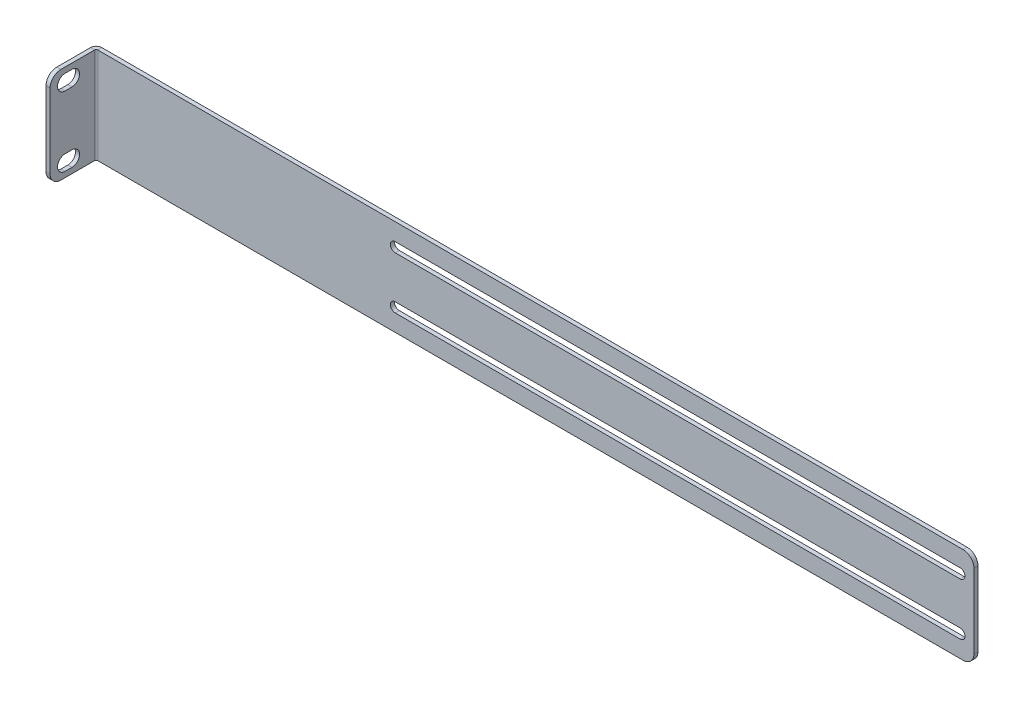
ISO-10303-21;
HEADER;
FILE_DESCRIPTION(('STEP AP214'),'2;1');
FILE_NAME('part.step','',(''),(''),'','','');
FILE_SCHEMA(('AUTOMOTIVE_DESIGN { 1 0 10303 214 1 1 1 1 }'));
ENDSEC;
DATA;
#1=APPLICATION_CONTEXT('core data for automotive mechanical design processes');
#2=APPLICATION_PROTOCOL_DEFINITION('international standard','automotive_design',2000,#1);
#3=PRODUCT_CONTEXT('',#1,'mechanical');
#4=PRODUCT('Part','Part','',(#3));
#5=PRODUCT_RELATED_PRODUCT_CATEGORY('part','',(#4));
#6=PRODUCT_DEFINITION_FORMATION('','',#4);
#7=PRODUCT_DEFINITION_CONTEXT('part definition',#1,'design');
#8=PRODUCT_DEFINITION('design','',#6,#7);
#9=PRODUCT_DEFINITION_SHAPE('','',#8);
#10=(LENGTH_UNIT() NAMED_UNIT(*) SI_UNIT(.MILLI.,.METRE.));
#11=(NAMED_UNIT(*) PLANE_ANGLE_UNIT() SI_UNIT($,.RADIAN.));
#12=(NAMED_UNIT(*) SI_UNIT($,.STERADIAN.) SOLID_ANGLE_UNIT());
#13=UNCERTAINTY_MEASURE_WITH_UNIT(LENGTH_MEASURE(1.E-05),#10,'distance_accuracy_value','');
#14=(GEOMETRIC_REPRESENTATION_CONTEXT(3) GLOBAL_UNCERTAINTY_ASSIGNED_CONTEXT((#13)) GLOBAL_UNIT_ASSIGNED_CONTEXT((#10,
#11,#12)) REPRESENTATION_CONTEXT('',''));
#15=CARTESIAN_POINT('',(0.,0.,0.));
#16=DIRECTION('',(0.,0.,1.));
#17=DIRECTION('',(1.,0.,0.));
#18=AXIS2_PLACEMENT_3D('',#15,#16,#17);
#19=CARTESIAN_POINT('',(0.,0.,-1.88));
#20=DIRECTION('',(0.,-1.,0.));
#21=DIRECTION('',(0.,0.,-1.));
#22=AXIS2_PLACEMENT_3D('',#19,#20,#21);
#23=PLANE('',#22);
#24=DIRECTION('',(1.,0.,0.));
#25=VECTOR('',#24,1.);
#26=CARTESIAN_POINT('',(0.,0.,-1.88));
#27=LINE('',#26,#25);
#28=CARTESIAN_POINT('',(2.6166,0.,-1.88));
#29=VERTEX_POINT('',#28);
#30=CARTESIAN_POINT('',(401.4,0.,-1.88));
#31=VERTEX_POINT('',#30);
#32=EDGE_CURVE('E436',#29,#31,#27,.T.);
#33=ORIENTED_EDGE('',*,*,#32,.T.);
#34=DIRECTION('',(0.,0.,1.));
#35=VECTOR('',#34,1.);
#36=CARTESIAN_POINT('',(401.4,0.,-1.88));
#37=LINE('',#36,#35);
#38=CARTESIAN_POINT('',(401.4,0.,0.));
#39=VERTEX_POINT('',#38);
#40=EDGE_CURVE('E445',#31,#39,#37,.T.);
#41=ORIENTED_EDGE('',*,*,#40,.T.);
#42=DIRECTION('',(1.,0.,0.));
#43=VECTOR('',#42,1.);
#44=CARTESIAN_POINT('',(0.,0.,0.));
#45=LINE('',#44,#43);
#46=CARTESIAN_POINT('',(2.6166,0.,0.));
#47=VERTEX_POINT('',#46);
#48=EDGE_CURVE('E429',#47,#39,#45,.T.);
#49=ORIENTED_EDGE('',*,*,#48,.F.);
#50=DIRECTION('',(0.,0.,-1.));
#51=VECTOR('',#50,1.);
#52=CARTESIAN_POINT('',(2.6166,0.,0.));
#53=LINE('',#52,#51);
#54=EDGE_CURVE('E355',#47,#29,#53,.T.);
#55=ORIENTED_EDGE('',*,*,#54,.T.);
#56=EDGE_LOOP('',(#33,#41,#49,#55));
#57=FACE_BOUND('',#56,.T.);
#58=ADVANCED_FACE('F61',(#57),#23,.T.);
#59=CARTESIAN_POINT('',(0.,0.,-1.88));
#60=DIRECTION('',(0.,0.,-1.));
#61=DIRECTION('',(-1.,0.,0.));
#62=AXIS2_PLACEMENT_3D('',#59,#60,#61);
#63=PLANE('',#62);
#64=CARTESIAN_POINT('',(139.7,9.99999999999994,-1.88));
#65=DIRECTION('',(0.,0.,1.));
#66=DIRECTION('',(1.,0.,0.));
#67=AXIS2_PLACEMENT_3D('',#64,#65,#66);
#68=CIRCLE('',#67,2.2225);
#69=CARTESIAN_POINT('',(139.7,12.2224999999999,-1.88));
#70=VERTEX_POINT('',#69);
#71=CARTESIAN_POINT('',(139.7,7.77749999999994,-1.88));
#72=VERTEX_POINT('',#71);
#73=EDGE_CURVE('E372',#70,#72,#68,.T.);
#74=ORIENTED_EDGE('',*,*,#73,.T.);
#75=DIRECTION('',(1.,0.,0.));
#76=VECTOR('',#75,1.);
#77=CARTESIAN_POINT('',(139.7,7.77749999999994,-1.88));
#78=LINE('',#77,#76);
#79=CARTESIAN_POINT('',(400.05,7.7775,-1.88));
#80=VERTEX_POINT('',#79);
#81=EDGE_CURVE('E375',#72,#80,#78,.T.);
#82=ORIENTED_EDGE('',*,*,#81,.T.);
#83=CARTESIAN_POINT('',(400.05,9.99999999999997,-1.88));
#84=DIRECTION('',(0.,0.,1.));
#85=DIRECTION('',(1.,0.,0.));
#86=AXIS2_PLACEMENT_3D('',#83,#84,#85);
#87=CIRCLE('',#86,2.2225);
#88=CARTESIAN_POINT('',(400.05,12.2225,-1.88));
#89=VERTEX_POINT('',#88);
#90=EDGE_CURVE('E379',#80,#89,#87,.T.);
#91=ORIENTED_EDGE('',*,*,#90,.T.);
#92=DIRECTION('',(-1.,0.,0.));
#93=VECTOR('',#92,1.);
#94=CARTESIAN_POINT('',(139.7,12.2224999999999,-1.88));
#95=LINE('',#94,#93);
#96=EDGE_CURVE('E382',#89,#70,#95,.T.);
#97=ORIENTED_EDGE('',*,*,#96,.T.);
#98=EDGE_LOOP('',(#74,#82,#91,#97));
#99=FACE_BOUND('',#98,.T.);
#100=CARTESIAN_POINT('',(139.7,33.9999999999999,-1.88));
#101=DIRECTION('',(0.,0.,1.));
#102=DIRECTION('',(1.,0.,0.));
#103=AXIS2_PLACEMENT_3D('',#100,#101,#102);
#104=CIRCLE('',#103,2.22250000000001);
#105=CARTESIAN_POINT('',(139.7,36.2224999999999,-1.88));
#106=VERTEX_POINT('',#105);
#107=CARTESIAN_POINT('',(139.7,31.7774999999999,-1.88));
#108=VERTEX_POINT('',#107);
#109=EDGE_CURVE('E404',#106,#108,#104,.T.);
#110=ORIENTED_EDGE('',*,*,#109,.T.);
#111=DIRECTION('',(1.,0.,0.));
#112=VECTOR('',#111,1.);
#113=CARTESIAN_POINT('',(139.7,31.7774999999999,-1.88));
#114=LINE('',#113,#112);
#115=CARTESIAN_POINT('',(400.05,31.7775,-1.88));
#116=VERTEX_POINT('',#115);
#117=EDGE_CURVE('E407',#108,#116,#114,.T.);
#118=ORIENTED_EDGE('',*,*,#117,.T.);
#119=CARTESIAN_POINT('',(400.05,34.,-1.88));
#120=DIRECTION('',(0.,0.,1.));
#121=DIRECTION('',(1.,0.,0.));
#122=AXIS2_PLACEMENT_3D('',#119,#120,#121);
#123=CIRCLE('',#122,2.2225);
#124=CARTESIAN_POINT('',(400.05,36.2225,-1.88));
#125=VERTEX_POINT('',#124);
#126=EDGE_CURVE('E411',#116,#125,#123,.T.);
#127=ORIENTED_EDGE('',*,*,#126,.T.);
#128=DIRECTION('',(-1.,0.,0.));
#129=VECTOR('',#128,1.);
#130=CARTESIAN_POINT('',(139.7,36.2224999999999,-1.88));
#131=LINE('',#130,#129);
#132=EDGE_CURVE('E414',#125,#106,#131,.T.);
#133=ORIENTED_EDGE('',*,*,#132,.T.);
#134=EDGE_LOOP('',(#110,#118,#127,#133));
#135=FACE_BOUND('',#134,.T.);
#136=DIRECTION('',(0.,1.,0.));
#137=VECTOR('',#136,1.);
#138=CARTESIAN_POINT('',(406.4,0.,-1.88));
#139=LINE('',#138,#137);
#140=CARTESIAN_POINT('',(406.4,5.,-1.88));
#141=VERTEX_POINT('',#140);
#142=CARTESIAN_POINT('',(406.4,39.196,-1.88));
#143=VERTEX_POINT('',#142);
#144=EDGE_CURVE('E439',#141,#143,#139,.T.);
#145=ORIENTED_EDGE('',*,*,#144,.F.);
#146=CARTESIAN_POINT('',(401.4,5.,-1.88));
#147=DIRECTION('',(0.,0.,-1.));
#148=DIRECTION('',(-1.,0.,0.));
#149=AXIS2_PLACEMENT_3D('',#146,#147,#148);
#150=CIRCLE('',#149,5.);
#151=EDGE_CURVE('E465',#141,#31,#150,.T.);
#152=ORIENTED_EDGE('',*,*,#151,.T.);
#153=ORIENTED_EDGE('',*,*,#32,.F.);
#154=DIRECTION('',(0.,-1.,0.));
#155=VECTOR('',#154,1.);
#156=CARTESIAN_POINT('',(2.6166,0.,-1.88));
#157=LINE('',#156,#155);
#158=CARTESIAN_POINT('',(2.6166,44.196,-1.88));
#159=VERTEX_POINT('',#158);
#160=EDGE_CURVE('E348',#29,#159,#157,.F.);
#161=ORIENTED_EDGE('',*,*,#160,.T.);
#162=DIRECTION('',(-1.,0.,0.));
#163=VECTOR('',#162,1.);
#164=CARTESIAN_POINT('',(0.,44.196,-1.88));
#165=LINE('',#164,#163);
#166=CARTESIAN_POINT('',(401.4,44.196,-1.88));
#167=VERTEX_POINT('',#166);
#168=EDGE_CURVE('E443',#167,#159,#165,.T.);
#169=ORIENTED_EDGE('',*,*,#168,.F.);
#170=CARTESIAN_POINT('',(401.4,39.196,-1.88));
#171=DIRECTION('',(0.,0.,-1.));
#172=DIRECTION('',(-1.,0.,0.));
#173=AXIS2_PLACEMENT_3D('',#170,#171,#172);
#174=CIRCLE('',#173,5.);
#175=EDGE_CURVE('E463',#167,#143,#174,.T.);
#176=ORIENTED_EDGE('',*,*,#175,.T.);
#177=EDGE_LOOP('',(#145,#152,#153,#161,#169,#176));
#178=FACE_BOUND('',#177,.T.);
#179=ADVANCED_FACE('F521',(#99,#135,#178),#63,.T.);
#180=CARTESIAN_POINT('',(0.,0.,0.));
#181=DIRECTION('',(0.,0.,-1.));
#182=DIRECTION('',(-1.,0.,0.));
#183=AXIS2_PLACEMENT_3D('',#180,#181,#182);
#184=PLANE('',#183);
#185=DIRECTION('',(1.,0.,0.));
#186=VECTOR('',#185,1.);
#187=CARTESIAN_POINT('',(139.7,31.7774999999999,0.));
#188=LINE('',#187,#186);
#189=CARTESIAN_POINT('',(139.7,31.7774999999999,0.));
#190=VERTEX_POINT('',#189);
#191=CARTESIAN_POINT('',(400.05,31.7775,0.));
#192=VERTEX_POINT('',#191);
#193=EDGE_CURVE('E419',#190,#192,#188,.T.);
#194=ORIENTED_EDGE('',*,*,#193,.F.);
#195=CARTESIAN_POINT('',(139.7,33.9999999999999,0.));
#196=DIRECTION('',(0.,0.,1.));
#197=DIRECTION('',(1.,0.,0.));
#198=AXIS2_PLACEMENT_3D('',#195,#196,#197);
#199=CIRCLE('',#198,2.22250000000001);
#200=CARTESIAN_POINT('',(139.7,36.2224999999999,0.));
#201=VERTEX_POINT('',#200);
#202=EDGE_CURVE('E397',#201,#190,#199,.T.);
#203=ORIENTED_EDGE('',*,*,#202,.F.);
#204=DIRECTION('',(-1.,0.,0.));
#205=VECTOR('',#204,1.);
#206=CARTESIAN_POINT('',(139.7,36.2224999999999,0.));
#207=LINE('',#206,#205);
#208=CARTESIAN_POINT('',(400.05,36.2225,0.));
#209=VERTEX_POINT('',#208);
#210=EDGE_CURVE('E408',#209,#201,#207,.T.);
#211=ORIENTED_EDGE('',*,*,#210,.F.);
#212=CARTESIAN_POINT('',(400.05,34.,0.));
#213=DIRECTION('',(0.,0.,1.));
#214=DIRECTION('',(1.,0.,0.));
#215=AXIS2_PLACEMENT_3D('',#212,#213,#214);
#216=CIRCLE('',#215,2.2225);
#217=EDGE_CURVE('E422',#192,#209,#216,.T.);
#218=ORIENTED_EDGE('',*,*,#217,.F.);
#219=EDGE_LOOP('',(#194,#203,#211,#218));
#220=FACE_BOUND('',#219,.T.);
#221=DIRECTION('',(1.,0.,0.));
#222=VECTOR('',#221,1.);
#223=CARTESIAN_POINT('',(139.7,7.77749999999994,0.));
#224=LINE('',#223,#222);
#225=CARTESIAN_POINT('',(139.7,7.77749999999994,0.));
#226=VERTEX_POINT('',#225);
#227=CARTESIAN_POINT('',(400.05,7.77749999999997,0.));
#228=VERTEX_POINT('',#227);
#229=EDGE_CURVE('E387',#226,#228,#224,.T.);
#230=ORIENTED_EDGE('',*,*,#229,.F.);
#231=CARTESIAN_POINT('',(139.7,9.99999999999994,0.));
#232=DIRECTION('',(0.,0.,1.));
#233=DIRECTION('',(1.,0.,0.));
#234=AXIS2_PLACEMENT_3D('',#231,#232,#233);
#235=CIRCLE('',#234,2.2225);
#236=CARTESIAN_POINT('',(139.7,12.2224999999999,0.));
#237=VERTEX_POINT('',#236);
#238=EDGE_CURVE('E369',#237,#226,#235,.T.);
#239=ORIENTED_EDGE('',*,*,#238,.F.);
#240=DIRECTION('',(-1.,0.,0.));
#241=VECTOR('',#240,1.);
#242=CARTESIAN_POINT('',(139.7,12.2224999999999,0.));
#243=LINE('',#242,#241);
#244=CARTESIAN_POINT('',(400.05,12.2225,0.));
#245=VERTEX_POINT('',#244);
#246=EDGE_CURVE('E376',#245,#237,#243,.T.);
#247=ORIENTED_EDGE('',*,*,#246,.F.);
#248=CARTESIAN_POINT('',(400.05,9.99999999999997,0.));
#249=DIRECTION('',(0.,0.,1.));
#250=DIRECTION('',(1.,0.,0.));
#251=AXIS2_PLACEMENT_3D('',#248,#249,#250);
#252=CIRCLE('',#251,2.2225);
#253=EDGE_CURVE('E390',#228,#245,#252,.T.);
#254=ORIENTED_EDGE('',*,*,#253,.F.);
#255=EDGE_LOOP('',(#230,#239,#247,#254));
#256=FACE_BOUND('',#255,.T.);
#257=ORIENTED_EDGE('',*,*,#48,.T.);
#258=CARTESIAN_POINT('',(401.4,5.,0.));
#259=DIRECTION('',(0.,0.,-1.));
#260=DIRECTION('',(-1.,0.,0.));
#261=AXIS2_PLACEMENT_3D('',#258,#259,#260);
#262=CIRCLE('',#261,5.);
#263=CARTESIAN_POINT('',(406.4,5.,0.));
#264=VERTEX_POINT('',#263);
#265=EDGE_CURVE('E456',#39,#264,#262,.F.);
#266=ORIENTED_EDGE('',*,*,#265,.T.);
#267=DIRECTION('',(0.,1.,0.));
#268=VECTOR('',#267,1.);
#269=CARTESIAN_POINT('',(406.4,0.,0.));
#270=LINE('',#269,#268);
#271=CARTESIAN_POINT('',(406.4,39.196,0.));
#272=VERTEX_POINT('',#271);
#273=EDGE_CURVE('E448',#264,#272,#270,.T.);
#274=ORIENTED_EDGE('',*,*,#273,.T.);
#275=CARTESIAN_POINT('',(401.4,39.196,0.));
#276=DIRECTION('',(0.,0.,-1.));
#277=DIRECTION('',(-1.,0.,0.));
#278=AXIS2_PLACEMENT_3D('',#275,#276,#277);
#279=CIRCLE('',#278,5.);
#280=CARTESIAN_POINT('',(401.4,44.196,0.));
#281=VERTEX_POINT('',#280);
#282=EDGE_CURVE('E454',#272,#281,#279,.F.);
#283=ORIENTED_EDGE('',*,*,#282,.T.);
#284=DIRECTION('',(-1.,0.,0.));
#285=VECTOR('',#284,1.);
#286=CARTESIAN_POINT('',(0.,44.196,0.));
#287=LINE('',#286,#285);
#288=CARTESIAN_POINT('',(2.6166,44.196,0.));
#289=VERTEX_POINT('',#288);
#290=EDGE_CURVE('E440',#281,#289,#287,.T.);
#291=ORIENTED_EDGE('',*,*,#290,.T.);
#292=DIRECTION('',(0.,-1.,0.));
#293=VECTOR('',#292,1.);
#294=CARTESIAN_POINT('',(2.6166,0.,0.));
#295=LINE('',#294,#293);
#296=EDGE_CURVE('E361',#47,#289,#295,.F.);
#297=ORIENTED_EDGE('',*,*,#296,.F.);
#298=EDGE_LOOP('',(#257,#266,#274,#283,#291,#297));
#299=FACE_BOUND('',#298,.T.);
#300=ADVANCED_FACE('F531',(#220,#256,#299),#184,.F.);
#301=CARTESIAN_POINT('',(0.,44.196,-1.88));
#302=DIRECTION('',(0.,1.,0.));
#303=DIRECTION('',(0.,0.,1.));
#304=AXIS2_PLACEMENT_3D('',#301,#302,#303);
#305=PLANE('',#304);
#306=ORIENTED_EDGE('',*,*,#290,.F.);
#307=DIRECTION('',(0.,0.,1.));
#308=VECTOR('',#307,1.);
#309=CARTESIAN_POINT('',(401.4,44.196,-1.88));
#310=LINE('',#309,#308);
#311=EDGE_CURVE('E467',#281,#167,#310,.F.);
#312=ORIENTED_EDGE('',*,*,#311,.T.);
#313=ORIENTED_EDGE('',*,*,#168,.T.);
#314=DIRECTION('',(0.,0.,-1.));
#315=VECTOR('',#314,1.);
#316=CARTESIAN_POINT('',(2.6166,44.196,0.));
#317=LINE('',#316,#315);
#318=EDGE_CURVE('E366',#289,#159,#317,.T.);
#319=ORIENTED_EDGE('',*,*,#318,.F.);
#320=EDGE_LOOP('',(#306,#312,#313,#319));
#321=FACE_BOUND('',#320,.T.);
#322=ADVANCED_FACE('F515',(#321),#305,.T.);
#323=CARTESIAN_POINT('',(406.4,0.,-1.88));
#324=DIRECTION('',(1.,0.,0.));
#325=DIRECTION('',(0.,0.,-1.));
#326=AXIS2_PLACEMENT_3D('',#323,#324,#325);
#327=PLANE('',#326);
#328=ORIENTED_EDGE('',*,*,#273,.F.);
#329=DIRECTION('',(0.,0.,1.));
#330=VECTOR('',#329,1.);
#331=CARTESIAN_POINT('',(406.4,5.,-1.88));
#332=LINE('',#331,#330);
#333=EDGE_CURVE('E461',#264,#141,#332,.F.);
#334=ORIENTED_EDGE('',*,*,#333,.T.);
#335=ORIENTED_EDGE('',*,*,#144,.T.);
#336=DIRECTION('',(0.,0.,1.));
#337=VECTOR('',#336,1.);
#338=CARTESIAN_POINT('',(406.4,39.196,-1.88));
#339=LINE('',#338,#337);
#340=EDGE_CURVE('E458',#143,#272,#339,.T.);
#341=ORIENTED_EDGE('',*,*,#340,.T.);
#342=EDGE_LOOP('',(#328,#334,#335,#341));
#343=FACE_BOUND('',#342,.T.);
#344=ADVANCED_FACE('F528',(#343),#327,.T.);
#345=CARTESIAN_POINT('',(139.7,33.9999999999999,-1.88));
#346=DIRECTION('',(0.,0.,1.));
#347=DIRECTION('',(1.,0.,0.));
#348=AXIS2_PLACEMENT_3D('',#345,#346,#347);
#349=CYLINDRICAL_SURFACE('',#348,2.22250000000001);
#350=ORIENTED_EDGE('',*,*,#202,.T.);
#351=DIRECTION('',(0.,0.,1.));
#352=VECTOR('',#351,1.);
#353=CARTESIAN_POINT('',(139.7,31.7774999999999,-1.88));
#354=LINE('',#353,#352);
#355=EDGE_CURVE('E417',#108,#190,#354,.T.);
#356=ORIENTED_EDGE('',*,*,#355,.F.);
#357=ORIENTED_EDGE('',*,*,#109,.F.);
#358=DIRECTION('',(0.,0.,1.));
#359=VECTOR('',#358,1.);
#360=CARTESIAN_POINT('',(139.7,36.2224999999999,-1.88));
#361=LINE('',#360,#359);
#362=EDGE_CURVE('E427',#106,#201,#361,.T.);
#363=ORIENTED_EDGE('',*,*,#362,.T.);
#364=EDGE_LOOP('',(#350,#356,#357,#363));
#365=FACE_BOUND('',#364,.T.);
#366=ADVANCED_FACE('F640',(#365),#349,.F.);
#367=CARTESIAN_POINT('',(139.7,36.2224999999999,-1.88));
#368=DIRECTION('',(0.,1.,0.));
#369=DIRECTION('',(-1.,0.,0.));
#370=AXIS2_PLACEMENT_3D('',#367,#368,#369);
#371=PLANE('',#370);
#372=ORIENTED_EDGE('',*,*,#210,.T.);
#373=ORIENTED_EDGE('',*,*,#362,.F.);
#374=ORIENTED_EDGE('',*,*,#132,.F.);
#375=DIRECTION('',(0.,0.,1.));
#376=VECTOR('',#375,1.);
#377=CARTESIAN_POINT('',(400.05,36.2225,-1.88));
#378=LINE('',#377,#376);
#379=EDGE_CURVE('E430',#125,#209,#378,.T.);
#380=ORIENTED_EDGE('',*,*,#379,.T.);
#381=EDGE_LOOP('',(#372,#373,#374,#380));
#382=FACE_BOUND('',#381,.T.);
#383=ADVANCED_FACE('F851',(#382),#371,.F.);
#384=CARTESIAN_POINT('',(400.05,34.,-1.88));
#385=DIRECTION('',(0.,0.,1.));
#386=DIRECTION('',(1.,0.,0.));
#387=AXIS2_PLACEMENT_3D('',#384,#385,#386);
#388=CYLINDRICAL_SURFACE('',#387,2.2225);
#389=ORIENTED_EDGE('',*,*,#217,.T.);
#390=ORIENTED_EDGE('',*,*,#379,.F.);
#391=ORIENTED_EDGE('',*,*,#126,.F.);
#392=DIRECTION('',(0.,0.,1.));
#393=VECTOR('',#392,1.);
#394=CARTESIAN_POINT('',(400.05,31.7775,-1.88));
#395=LINE('',#394,#393);
#396=EDGE_CURVE('E432',#116,#192,#395,.T.);
#397=ORIENTED_EDGE('',*,*,#396,.T.);
#398=EDGE_LOOP('',(#389,#390,#391,#397));
#399=FACE_BOUND('',#398,.T.);
#400=ADVANCED_FACE('F840',(#399),#388,.F.);
#401=CARTESIAN_POINT('',(139.7,31.7774999999999,-1.88));
#402=DIRECTION('',(0.,-1.,0.));
#403=DIRECTION('',(1.,0.,0.));
#404=AXIS2_PLACEMENT_3D('',#401,#402,#403);
#405=PLANE('',#404);
#406=ORIENTED_EDGE('',*,*,#193,.T.);
#407=ORIENTED_EDGE('',*,*,#396,.F.);
#408=ORIENTED_EDGE('',*,*,#117,.F.);
#409=ORIENTED_EDGE('',*,*,#355,.T.);
#410=EDGE_LOOP('',(#406,#407,#408,#409));
#411=FACE_BOUND('',#410,.T.);
#412=ADVANCED_FACE('F829',(#411),#405,.F.);
#413=CARTESIAN_POINT('',(139.7,9.99999999999994,-1.88));
#414=DIRECTION('',(0.,0.,1.));
#415=DIRECTION('',(1.,0.,0.));
#416=AXIS2_PLACEMENT_3D('',#413,#414,#415);
#417=CYLINDRICAL_SURFACE('',#416,2.2225);
#418=ORIENTED_EDGE('',*,*,#238,.T.);
#419=DIRECTION('',(0.,0.,1.));
#420=VECTOR('',#419,1.);
#421=CARTESIAN_POINT('',(139.7,7.77749999999994,-1.88));
#422=LINE('',#421,#420);
#423=EDGE_CURVE('E385',#72,#226,#422,.T.);
#424=ORIENTED_EDGE('',*,*,#423,.F.);
#425=ORIENTED_EDGE('',*,*,#73,.F.);
#426=DIRECTION('',(0.,0.,1.));
#427=VECTOR('',#426,1.);
#428=CARTESIAN_POINT('',(139.7,12.2224999999999,-1.88));
#429=LINE('',#428,#427);
#430=EDGE_CURVE('E395',#70,#237,#429,.T.);
#431=ORIENTED_EDGE('',*,*,#430,.T.);
#432=EDGE_LOOP('',(#418,#424,#425,#431));
#433=FACE_BOUND('',#432,.T.);
#434=ADVANCED_FACE('F818',(#433),#417,.F.);
#435=CARTESIAN_POINT('',(139.7,12.2224999999999,-1.88));
#436=DIRECTION('',(0.,1.,0.));
#437=DIRECTION('',(-1.,0.,0.));
#438=AXIS2_PLACEMENT_3D('',#435,#436,#437);
#439=PLANE('',#438);
#440=ORIENTED_EDGE('',*,*,#246,.T.);
#441=ORIENTED_EDGE('',*,*,#430,.F.);
#442=ORIENTED_EDGE('',*,*,#96,.F.);
#443=DIRECTION('',(0.,0.,1.));
#444=VECTOR('',#443,1.);
#445=CARTESIAN_POINT('',(400.05,12.2225,-1.88));
#446=LINE('',#445,#444);
#447=EDGE_CURVE('E398',#89,#245,#446,.T.);
#448=ORIENTED_EDGE('',*,*,#447,.T.);
#449=EDGE_LOOP('',(#440,#441,#442,#448));
#450=FACE_BOUND('',#449,.T.);
#451=ADVANCED_FACE('F807',(#450),#439,.F.);
#452=CARTESIAN_POINT('',(400.05,9.99999999999997,-1.88));
#453=DIRECTION('',(0.,0.,1.));
#454=DIRECTION('',(1.,0.,0.));
#455=AXIS2_PLACEMENT_3D('',#452,#453,#454);
#456=CYLINDRICAL_SURFACE('',#455,2.2225);
#457=ORIENTED_EDGE('',*,*,#253,.T.);
#458=ORIENTED_EDGE('',*,*,#447,.F.);
#459=ORIENTED_EDGE('',*,*,#90,.F.);
#460=DIRECTION('',(0.,0.,1.));
#461=VECTOR('',#460,1.);
#462=CARTESIAN_POINT('',(400.05,7.77749999999997,-1.88));
#463=LINE('',#462,#461);
#464=EDGE_CURVE('E400',#80,#228,#463,.T.);
#465=ORIENTED_EDGE('',*,*,#464,.T.);
#466=EDGE_LOOP('',(#457,#458,#459,#465));
#467=FACE_BOUND('',#466,.T.);
#468=ADVANCED_FACE('F795',(#467),#456,.F.);
#469=CARTESIAN_POINT('',(139.7,7.77749999999994,-1.88));
#470=DIRECTION('',(0.,-1.,0.));
#471=DIRECTION('',(1.,0.,0.));
#472=AXIS2_PLACEMENT_3D('',#469,#470,#471);
#473=PLANE('',#472);
#474=ORIENTED_EDGE('',*,*,#229,.T.);
#475=ORIENTED_EDGE('',*,*,#464,.F.);
#476=ORIENTED_EDGE('',*,*,#81,.F.);
#477=ORIENTED_EDGE('',*,*,#423,.T.);
#478=EDGE_LOOP('',(#474,#475,#476,#477));
#479=FACE_BOUND('',#478,.T.);
#480=ADVANCED_FACE('F784',(#479),#473,.F.);
#481=CARTESIAN_POINT('',(2.6166,44.196,0.7366));
#482=DIRECTION('',(0.,1.,0.));
#483=DIRECTION('',(0.,0.,1.));
#484=AXIS2_PLACEMENT_3D('',#481,#482,#483);
#485=PLANE('',#484);
#486=DIRECTION('',(1.,0.,0.));
#487=VECTOR('',#486,1.);
#488=CARTESIAN_POINT('',(0.,44.196,0.736599999999991));
#489=LINE('',#488,#487);
#490=CARTESIAN_POINT('',(1.88,44.196,0.736599999999997));
#491=VERTEX_POINT('',#490);
#492=CARTESIAN_POINT('',(0.,44.196,0.736599999999991));
#493=VERTEX_POINT('',#492);
#494=EDGE_CURVE('E260',#491,#493,#489,.F.);
#495=ORIENTED_EDGE('',*,*,#494,.F.);
#496=CARTESIAN_POINT('',(2.6166,44.196,0.7366));
#497=DIRECTION('',(0.,-1.,0.));
#498=DIRECTION('',(0.,0.,-1.));
#499=AXIS2_PLACEMENT_3D('',#496,#497,#498);
#500=CIRCLE('',#499,0.7366);
#501=EDGE_CURVE('E358',#289,#491,#500,.F.);
#502=ORIENTED_EDGE('',*,*,#501,.F.);
#503=ORIENTED_EDGE('',*,*,#318,.T.);
#504=CARTESIAN_POINT('',(2.6166,44.196,0.7366));
#505=DIRECTION('',(0.,-1.,0.));
#506=DIRECTION('',(0.,0.,-1.));
#507=AXIS2_PLACEMENT_3D('',#504,#505,#506);
#508=CIRCLE('',#507,2.6166);
#509=EDGE_CURVE('E351',#159,#493,#508,.F.);
#510=ORIENTED_EDGE('',*,*,#509,.T.);
#511=EDGE_LOOP('',(#495,#502,#503,#510));
#512=FACE_BOUND('',#511,.T.);
#513=ADVANCED_FACE('F503',(#512),#485,.T.);
#514=CARTESIAN_POINT('',(2.6166,0.,0.7366));
#515=DIRECTION('',(0.,1.,0.));
#516=DIRECTION('',(0.,0.,1.));
#517=AXIS2_PLACEMENT_3D('',#514,#515,#516);
#518=PLANE('',#517);
#519=CARTESIAN_POINT('',(2.6166,0.,0.7366));
#520=DIRECTION('',(0.,-1.,0.));
#521=DIRECTION('',(0.,0.,-1.));
#522=AXIS2_PLACEMENT_3D('',#519,#520,#521);
#523=CIRCLE('',#522,0.7366);
#524=CARTESIAN_POINT('',(1.88,0.,0.736599999999997));
#525=VERTEX_POINT('',#524);
#526=EDGE_CURVE('E326',#525,#47,#523,.T.);
#527=ORIENTED_EDGE('',*,*,#526,.F.);
#528=DIRECTION('',(1.,0.,0.));
#529=VECTOR('',#528,1.);
#530=CARTESIAN_POINT('',(1.88,0.,0.736599999999997));
#531=LINE('',#530,#529);
#532=CARTESIAN_POINT('',(0.,0.,0.736599999999991));
#533=VERTEX_POINT('',#532);
#534=EDGE_CURVE('E341',#525,#533,#531,.F.);
#535=ORIENTED_EDGE('',*,*,#534,.T.);
#536=CARTESIAN_POINT('',(2.6166,0.,0.7366));
#537=DIRECTION('',(0.,-1.,0.));
#538=DIRECTION('',(0.,0.,-1.));
#539=AXIS2_PLACEMENT_3D('',#536,#537,#538);
#540=CIRCLE('',#539,2.6166);
#541=EDGE_CURVE('E352',#533,#29,#540,.T.);
#542=ORIENTED_EDGE('',*,*,#541,.T.);
#543=ORIENTED_EDGE('',*,*,#54,.F.);
#544=EDGE_LOOP('',(#527,#535,#542,#543));
#545=FACE_BOUND('',#544,.T.);
#546=ADVANCED_FACE('F497',(#545),#518,.F.);
#547=CARTESIAN_POINT('',(2.6166,0.,0.7366));
#548=DIRECTION('',(0.,-1.,0.));
#549=DIRECTION('',(-1.,0.,0.));
#550=AXIS2_PLACEMENT_3D('',#547,#548,#549);
#551=CYLINDRICAL_SURFACE('',#550,2.6166);
#552=ORIENTED_EDGE('',*,*,#160,.F.);
#553=ORIENTED_EDGE('',*,*,#541,.F.);
#554=DIRECTION('',(0.,-1.,0.));
#555=VECTOR('',#554,1.);
#556=CARTESIAN_POINT('',(0.,44.196,0.736599999999991));
#557=LINE('',#556,#555);
#558=EDGE_CURVE('E338',#533,#493,#557,.F.);
#559=ORIENTED_EDGE('',*,*,#558,.T.);
#560=ORIENTED_EDGE('',*,*,#509,.F.);
#561=EDGE_LOOP('',(#552,#553,#559,#560));
#562=FACE_BOUND('',#561,.T.);
#563=ADVANCED_FACE('F500',(#562),#551,.T.);
#564=CARTESIAN_POINT('',(2.6166,0.,0.7366));
#565=DIRECTION('',(0.,-1.,0.));
#566=DIRECTION('',(-1.,0.,0.));
#567=AXIS2_PLACEMENT_3D('',#564,#565,#566);
#568=CYLINDRICAL_SURFACE('',#567,0.7366);
#569=ORIENTED_EDGE('',*,*,#296,.T.);
#570=ORIENTED_EDGE('',*,*,#501,.T.);
#571=DIRECTION('',(0.,-1.,0.));
#572=VECTOR('',#571,1.);
#573=CARTESIAN_POINT('',(1.88,44.196,0.736599999999997));
#574=LINE('',#573,#572);
#575=EDGE_CURVE('E344',#491,#525,#574,.T.);
#576=ORIENTED_EDGE('',*,*,#575,.T.);
#577=ORIENTED_EDGE('',*,*,#526,.T.);
#578=EDGE_LOOP('',(#569,#570,#576,#577));
#579=FACE_BOUND('',#578,.T.);
#580=ADVANCED_FACE('F511',(#579),#568,.F.);
#581=CARTESIAN_POINT('',(0.,0.,21.234));
#582=DIRECTION('',(0.,1.,0.));
#583=DIRECTION('',(0.,0.,1.));
#584=AXIS2_PLACEMENT_3D('',#581,#582,#583);
#585=PLANE('',#584);
#586=DIRECTION('',(0.,0.,-1.));
#587=VECTOR('',#586,1.);
#588=CARTESIAN_POINT('',(1.87999999999993,0.,21.234));
#589=LINE('',#588,#587);
#590=CARTESIAN_POINT('',(1.87999999999994,0.,16.234));
#591=VERTEX_POINT('',#590);
#592=EDGE_CURVE('E336',#525,#591,#589,.F.);
#593=ORIENTED_EDGE('',*,*,#592,.T.);
#594=DIRECTION('',(1.,0.,0.));
#595=VECTOR('',#594,1.);
#596=CARTESIAN_POINT('',(0.,0.,16.234));
#597=LINE('',#596,#595);
#598=CARTESIAN_POINT('',(0.,0.,16.234));
#599=VERTEX_POINT('',#598);
#600=EDGE_CURVE('E84',#591,#599,#597,.F.);
#601=ORIENTED_EDGE('',*,*,#600,.T.);
#602=DIRECTION('',(0.,0.,1.));
#603=VECTOR('',#602,1.);
#604=CARTESIAN_POINT('',(0.,0.,0.));
#605=LINE('',#604,#603);
#606=EDGE_CURVE('E329',#533,#599,#605,.T.);
#607=ORIENTED_EDGE('',*,*,#606,.F.);
#608=ORIENTED_EDGE('',*,*,#534,.F.);
#609=EDGE_LOOP('',(#593,#601,#607,#608));
#610=FACE_BOUND('',#609,.T.);
#611=ADVANCED_FACE('F494',(#610),#585,.F.);
#612=CARTESIAN_POINT('',(0.,44.196,0.));
#613=DIRECTION('',(0.,-1.,0.));
#614=DIRECTION('',(0.,0.,-1.));
#615=AXIS2_PLACEMENT_3D('',#612,#613,#614);
#616=PLANE('',#615);
#617=DIRECTION('',(0.,0.,-1.));
#618=VECTOR('',#617,1.);
#619=CARTESIAN_POINT('',(0.,44.196,0.));
#620=LINE('',#619,#618);
#621=CARTESIAN_POINT('',(0.,44.196,16.234));
#622=VERTEX_POINT('',#621);
#623=EDGE_CURVE('E324',#622,#493,#620,.T.);
#624=ORIENTED_EDGE('',*,*,#623,.F.);
#625=DIRECTION('',(1.,0.,0.));
#626=VECTOR('',#625,1.);
#627=CARTESIAN_POINT('',(0.,44.196,16.234));
#628=LINE('',#627,#626);
#629=CARTESIAN_POINT('',(1.87999999999994,44.196,16.234));
#630=VERTEX_POINT('',#629);
#631=EDGE_CURVE('E13',#622,#630,#628,.T.);
#632=ORIENTED_EDGE('',*,*,#631,.T.);
#633=DIRECTION('',(0.,0.,1.));
#634=VECTOR('',#633,1.);
#635=CARTESIAN_POINT('',(1.88,44.196,0.));
#636=LINE('',#635,#634);
#637=EDGE_CURVE('E331',#630,#491,#636,.F.);
#638=ORIENTED_EDGE('',*,*,#637,.T.);
#639=ORIENTED_EDGE('',*,*,#494,.T.);
#640=EDGE_LOOP('',(#624,#632,#638,#639));
#641=FACE_BOUND('',#640,.T.);
#642=ADVANCED_FACE('F507',(#641),#616,.F.);
#643=CARTESIAN_POINT('',(0.,0.,0.));
#644=DIRECTION('',(1.,0.,0.));
#645=DIRECTION('',(0.,0.,-1.));
#646=AXIS2_PLACEMENT_3D('',#643,#644,#645);
#647=PLANE('',#646);
#648=DIRECTION('',(0.,0.,1.));
#649=VECTOR('',#648,1.);
#650=CARTESIAN_POINT('',(0.,34.656,11.145));
#651=LINE('',#650,#649);
#652=CARTESIAN_POINT('',(0.,34.656,11.145));
#653=VERTEX_POINT('',#652);
#654=CARTESIAN_POINT('',(0.,34.656,14.305));
#655=VERTEX_POINT('',#654);
#656=EDGE_CURVE('E276',#653,#655,#651,.T.);
#657=ORIENTED_EDGE('',*,*,#656,.F.);
#658=CARTESIAN_POINT('',(0.,38.156,11.145));
#659=DIRECTION('',(-1.,0.,0.));
#660=DIRECTION('',(0.,0.,1.));
#661=AXIS2_PLACEMENT_3D('',#658,#659,#660);
#662=CIRCLE('',#661,3.49999999999999);
#663=CARTESIAN_POINT('',(0.,41.656,11.145));
#664=VERTEX_POINT('',#663);
#665=EDGE_CURVE('E268',#664,#653,#662,.T.);
#666=ORIENTED_EDGE('',*,*,#665,.F.);
#667=DIRECTION('',(0.,0.,-1.));
#668=VECTOR('',#667,1.);
#669=CARTESIAN_POINT('',(0.,41.656,11.145));
#670=LINE('',#669,#668);
#671=CARTESIAN_POINT('',(0.,41.656,14.305));
#672=VERTEX_POINT('',#671);
#673=EDGE_CURVE('E269',#672,#664,#670,.T.);
#674=ORIENTED_EDGE('',*,*,#673,.F.);
#675=CARTESIAN_POINT('',(0.,38.156,14.305));
#676=DIRECTION('',(-1.,0.,0.));
#677=DIRECTION('',(0.,0.,1.));
#678=AXIS2_PLACEMENT_3D('',#675,#676,#677);
#679=CIRCLE('',#678,3.49999999999999);
#680=EDGE_CURVE('E283',#655,#672,#679,.T.);
#681=ORIENTED_EDGE('',*,*,#680,.F.);
#682=EDGE_LOOP('',(#657,#666,#674,#681));
#683=FACE_BOUND('',#682,.T.);
#684=DIRECTION('',(0.,0.,1.));
#685=VECTOR('',#684,1.);
#686=CARTESIAN_POINT('',(0.,2.54,11.145));
#687=LINE('',#686,#685);
#688=CARTESIAN_POINT('',(0.,2.54,11.145));
#689=VERTEX_POINT('',#688);
#690=CARTESIAN_POINT('',(0.,2.54,14.305));
#691=VERTEX_POINT('',#690);
#692=EDGE_CURVE('E310',#689,#691,#687,.T.);
#693=ORIENTED_EDGE('',*,*,#692,.F.);
#694=CARTESIAN_POINT('',(0.,6.04,11.145));
#695=DIRECTION('',(-1.,0.,0.));
#696=DIRECTION('',(0.,0.,1.));
#697=AXIS2_PLACEMENT_3D('',#694,#695,#696);
#698=CIRCLE('',#697,3.5);
#699=CARTESIAN_POINT('',(0.,9.54,11.145));
#700=VERTEX_POINT('',#699);
#701=EDGE_CURVE('E313',#700,#689,#698,.T.);
#702=ORIENTED_EDGE('',*,*,#701,.F.);
#703=DIRECTION('',(0.,0.,-1.));
#704=VECTOR('',#703,1.);
#705=CARTESIAN_POINT('',(0.,9.54,11.145));
#706=LINE('',#705,#704);
#707=CARTESIAN_POINT('',(0.,9.54000000000001,14.305));
#708=VERTEX_POINT('',#707);
#709=EDGE_CURVE('E299',#708,#700,#706,.T.);
#710=ORIENTED_EDGE('',*,*,#709,.F.);
#711=CARTESIAN_POINT('',(0.,6.04,14.305));
#712=DIRECTION('',(-1.,0.,0.));
#713=DIRECTION('',(0.,0.,1.));
#714=AXIS2_PLACEMENT_3D('',#711,#712,#713);
#715=CIRCLE('',#714,3.5);
#716=EDGE_CURVE('E307',#691,#708,#715,.T.);
#717=ORIENTED_EDGE('',*,*,#716,.F.);
#718=EDGE_LOOP('',(#693,#702,#710,#717));
#719=FACE_BOUND('',#718,.T.);
#720=ORIENTED_EDGE('',*,*,#606,.T.);
#721=CARTESIAN_POINT('',(0.,5.,16.234));
#722=DIRECTION('',(1.,0.,0.));
#723=DIRECTION('',(0.,0.,-1.));
#724=AXIS2_PLACEMENT_3D('',#721,#722,#723);
#725=CIRCLE('',#724,5.);
#726=CARTESIAN_POINT('',(0.,5.,21.234));
#727=VERTEX_POINT('',#726);
#728=EDGE_CURVE('E69',#599,#727,#725,.F.);
#729=ORIENTED_EDGE('',*,*,#728,.T.);
#730=DIRECTION('',(0.,1.,0.));
#731=VECTOR('',#730,1.);
#732=CARTESIAN_POINT('',(0.,0.,21.234));
#733=LINE('',#732,#731);
#734=CARTESIAN_POINT('',(0.,39.196,21.234));
#735=VERTEX_POINT('',#734);
#736=EDGE_CURVE('E327',#727,#735,#733,.T.);
#737=ORIENTED_EDGE('',*,*,#736,.T.);
#738=CARTESIAN_POINT('',(0.,39.196,16.234));
#739=DIRECTION('',(1.,0.,0.));
#740=DIRECTION('',(0.,0.,-1.));
#741=AXIS2_PLACEMENT_3D('',#738,#739,#740);
#742=CIRCLE('',#741,5.);
#743=EDGE_CURVE('E76',#735,#622,#742,.F.);
#744=ORIENTED_EDGE('',*,*,#743,.T.);
#745=ORIENTED_EDGE('',*,*,#623,.T.);
#746=ORIENTED_EDGE('',*,*,#558,.F.);
#747=EDGE_LOOP('',(#720,#729,#737,#744,#745,#746));
#748=FACE_BOUND('',#747,.T.);
#749=ADVANCED_FACE('F481',(#683,#719,#748),#647,.F.);
#750=CARTESIAN_POINT('',(1.88,0.,0.));
#751=DIRECTION('',(1.,0.,0.));
#752=DIRECTION('',(0.,0.,-1.));
#753=AXIS2_PLACEMENT_3D('',#750,#751,#752);
#754=PLANE('',#753);
#755=CARTESIAN_POINT('',(1.87999999999994,38.156,11.145));
#756=DIRECTION('',(1.,0.,0.));
#757=DIRECTION('',(0.,0.,-1.));
#758=AXIS2_PLACEMENT_3D('',#755,#756,#757);
#759=CIRCLE('',#758,3.49999999999999);
#760=CARTESIAN_POINT('',(1.87999999999994,41.656,11.145));
#761=VERTEX_POINT('',#760);
#762=CARTESIAN_POINT('',(1.87999999999994,34.656,11.145));
#763=VERTEX_POINT('',#762);
#764=EDGE_CURVE('E265',#761,#763,#759,.F.);
#765=ORIENTED_EDGE('',*,*,#764,.T.);
#766=DIRECTION('',(0.,0.,1.));
#767=VECTOR('',#766,1.);
#768=CARTESIAN_POINT('',(1.87999999999994,34.656,11.145));
#769=LINE('',#768,#767);
#770=CARTESIAN_POINT('',(1.87999999999995,34.656,14.305));
#771=VERTEX_POINT('',#770);
#772=EDGE_CURVE('E249',#763,#771,#769,.T.);
#773=ORIENTED_EDGE('',*,*,#772,.T.);
#774=CARTESIAN_POINT('',(1.87999999999994,38.156,14.305));
#775=DIRECTION('',(1.,0.,0.));
#776=DIRECTION('',(0.,0.,-1.));
#777=AXIS2_PLACEMENT_3D('',#774,#775,#776);
#778=CIRCLE('',#777,3.49999999999999);
#779=CARTESIAN_POINT('',(1.87999999999994,41.656,14.3050000000007));
#780=VERTEX_POINT('',#779);
#781=EDGE_CURVE('E278',#771,#780,#778,.F.);
#782=ORIENTED_EDGE('',*,*,#781,.T.);
#783=DIRECTION('',(0.,0.,-1.));
#784=VECTOR('',#783,1.);
#785=CARTESIAN_POINT('',(1.87999999999994,41.656,11.145));
#786=LINE('',#785,#784);
#787=EDGE_CURVE('E274',#780,#761,#786,.T.);
#788=ORIENTED_EDGE('',*,*,#787,.T.);
#789=EDGE_LOOP('',(#765,#773,#782,#788));
#790=FACE_BOUND('',#789,.T.);
#791=CARTESIAN_POINT('',(1.87999999999994,6.04,11.145));
#792=DIRECTION('',(1.,0.,0.));
#793=DIRECTION('',(0.,0.,-1.));
#794=AXIS2_PLACEMENT_3D('',#791,#792,#793);
#795=CIRCLE('',#794,3.5);
#796=CARTESIAN_POINT('',(1.87999999999994,9.54,11.145));
#797=VERTEX_POINT('',#796);
#798=CARTESIAN_POINT('',(1.87999999999994,2.54,11.145));
#799=VERTEX_POINT('',#798);
#800=EDGE_CURVE('E315',#797,#799,#795,.F.);
#801=ORIENTED_EDGE('',*,*,#800,.T.);
#802=DIRECTION('',(0.,0.,1.));
#803=VECTOR('',#802,1.);
#804=CARTESIAN_POINT('',(1.87999999999994,2.54,11.145));
#805=LINE('',#804,#803);
#806=CARTESIAN_POINT('',(1.87999999999995,2.54,14.305));
#807=VERTEX_POINT('',#806);
#808=EDGE_CURVE('E292',#799,#807,#805,.T.);
#809=ORIENTED_EDGE('',*,*,#808,.T.);
#810=CARTESIAN_POINT('',(1.87999999999994,6.04,14.305));
#811=DIRECTION('',(1.,0.,0.));
#812=DIRECTION('',(0.,0.,-1.));
#813=AXIS2_PLACEMENT_3D('',#810,#811,#812);
#814=CIRCLE('',#813,3.5);
#815=CARTESIAN_POINT('',(1.87999999999994,9.54000000000001,14.3050000000007));
#816=VERTEX_POINT('',#815);
#817=EDGE_CURVE('E321',#807,#816,#814,.F.);
#818=ORIENTED_EDGE('',*,*,#817,.T.);
#819=DIRECTION('',(0.,0.,-1.));
#820=VECTOR('',#819,1.);
#821=CARTESIAN_POINT('',(1.87999999999994,9.54,11.145));
#822=LINE('',#821,#820);
#823=EDGE_CURVE('E318',#816,#797,#822,.T.);
#824=ORIENTED_EDGE('',*,*,#823,.T.);
#825=EDGE_LOOP('',(#801,#809,#818,#824));
#826=FACE_BOUND('',#825,.T.);
#827=DIRECTION('',(0.,-1.,0.));
#828=VECTOR('',#827,1.);
#829=CARTESIAN_POINT('',(1.87999999999993,44.196,21.234));
#830=LINE('',#829,#828);
#831=CARTESIAN_POINT('',(1.87999999999993,5.,21.234));
#832=VERTEX_POINT('',#831);
#833=CARTESIAN_POINT('',(1.87999999999993,39.196,21.234));
#834=VERTEX_POINT('',#833);
#835=EDGE_CURVE('E333',#832,#834,#830,.F.);
#836=ORIENTED_EDGE('',*,*,#835,.F.);
#837=CARTESIAN_POINT('',(1.87999999999994,5.,16.234));
#838=DIRECTION('',(1.,0.,0.));
#839=DIRECTION('',(0.,0.,-1.));
#840=AXIS2_PLACEMENT_3D('',#837,#838,#839);
#841=CIRCLE('',#840,5.);
#842=EDGE_CURVE('E476',#832,#591,#841,.T.);
#843=ORIENTED_EDGE('',*,*,#842,.T.);
#844=ORIENTED_EDGE('',*,*,#592,.F.);
#845=ORIENTED_EDGE('',*,*,#575,.F.);
#846=ORIENTED_EDGE('',*,*,#637,.F.);
#847=CARTESIAN_POINT('',(1.87999999999994,39.196,16.234));
#848=DIRECTION('',(1.,0.,0.));
#849=DIRECTION('',(0.,0.,-1.));
#850=AXIS2_PLACEMENT_3D('',#847,#848,#849);
#851=CIRCLE('',#850,5.);
#852=EDGE_CURVE('E474',#630,#834,#851,.T.);
#853=ORIENTED_EDGE('',*,*,#852,.T.);
#854=EDGE_LOOP('',(#836,#843,#844,#845,#846,#853));
#855=FACE_BOUND('',#854,.T.);
#856=ADVANCED_FACE('F272',(#790,#826,#855),#754,.T.);
#857=CARTESIAN_POINT('',(0.,44.196,21.234));
#858=DIRECTION('',(0.,0.,-1.));
#859=DIRECTION('',(-1.,0.,0.));
#860=AXIS2_PLACEMENT_3D('',#857,#858,#859);
#861=PLANE('',#860);
#862=ORIENTED_EDGE('',*,*,#736,.F.);
#863=DIRECTION('',(1.,0.,0.));
#864=VECTOR('',#863,1.);
#865=CARTESIAN_POINT('',(0.,5.,21.234));
#866=LINE('',#865,#864);
#867=EDGE_CURVE('E471',#727,#832,#866,.T.);
#868=ORIENTED_EDGE('',*,*,#867,.T.);
#869=ORIENTED_EDGE('',*,*,#835,.T.);
#870=DIRECTION('',(1.,0.,0.));
#871=VECTOR('',#870,1.);
#872=CARTESIAN_POINT('',(0.,39.196,21.234));
#873=LINE('',#872,#871);
#874=EDGE_CURVE('E469',#834,#735,#873,.F.);
#875=ORIENTED_EDGE('',*,*,#874,.T.);
#876=EDGE_LOOP('',(#862,#868,#869,#875));
#877=FACE_BOUND('',#876,.T.);
#878=ADVANCED_FACE('F486',(#877),#861,.F.);
#879=CARTESIAN_POINT('',(406.401,6.04,11.1450000000014));
#880=DIRECTION('',(-1.,0.,0.));
#881=DIRECTION('',(0.,0.,1.));
#882=AXIS2_PLACEMENT_3D('',#879,#880,#881);
#883=CYLINDRICAL_SURFACE('',#882,3.5);
#884=DIRECTION('',(-1.,0.,0.));
#885=VECTOR('',#884,1.);
#886=CARTESIAN_POINT('',(406.401,9.54,11.1450000000014));
#887=LINE('',#886,#885);
#888=EDGE_CURVE('E295',#797,#700,#887,.T.);
#889=ORIENTED_EDGE('',*,*,#888,.T.);
#890=ORIENTED_EDGE('',*,*,#701,.T.);
#891=DIRECTION('',(-1.,0.,0.));
#892=VECTOR('',#891,1.);
#893=CARTESIAN_POINT('',(406.401,2.54,11.1450000000014));
#894=LINE('',#893,#892);
#895=EDGE_CURVE('E296',#799,#689,#894,.T.);
#896=ORIENTED_EDGE('',*,*,#895,.F.);
#897=ORIENTED_EDGE('',*,*,#800,.F.);
#898=EDGE_LOOP('',(#889,#890,#896,#897));
#899=FACE_BOUND('',#898,.T.);
#900=ADVANCED_FACE('F589',(#899),#883,.F.);
#901=CARTESIAN_POINT('',(406.401,9.54,11.1450000000014));
#902=DIRECTION('',(0.,1.,0.));
#903=DIRECTION('',(0.,0.,1.));
#904=AXIS2_PLACEMENT_3D('',#901,#902,#903);
#905=PLANE('',#904);
#906=DIRECTION('',(-1.,0.,0.));
#907=VECTOR('',#906,1.);
#908=CARTESIAN_POINT('',(406.401,9.54000000000001,14.3050000000014));
#909=LINE('',#908,#907);
#910=EDGE_CURVE('E302',#816,#708,#909,.T.);
#911=ORIENTED_EDGE('',*,*,#910,.T.);
#912=ORIENTED_EDGE('',*,*,#709,.T.);
#913=ORIENTED_EDGE('',*,*,#888,.F.);
#914=ORIENTED_EDGE('',*,*,#823,.F.);
#915=EDGE_LOOP('',(#911,#912,#913,#914));
#916=FACE_BOUND('',#915,.T.);
#917=ADVANCED_FACE('F730',(#916),#905,.F.);
#918=CARTESIAN_POINT('',(406.401,6.04,14.3050000000014));
#919=DIRECTION('',(-1.,0.,0.));
#920=DIRECTION('',(0.,0.,1.));
#921=AXIS2_PLACEMENT_3D('',#918,#919,#920);
#922=CYLINDRICAL_SURFACE('',#921,3.5);
#923=DIRECTION('',(-1.,0.,0.));
#924=VECTOR('',#923,1.);
#925=CARTESIAN_POINT('',(406.401,2.54,14.3050000000014));
#926=LINE('',#925,#924);
#927=EDGE_CURVE('E300',#807,#691,#926,.T.);
#928=ORIENTED_EDGE('',*,*,#927,.T.);
#929=ORIENTED_EDGE('',*,*,#716,.T.);
#930=ORIENTED_EDGE('',*,*,#910,.F.);
#931=ORIENTED_EDGE('',*,*,#817,.F.);
#932=EDGE_LOOP('',(#928,#929,#930,#931));
#933=FACE_BOUND('',#932,.T.);
#934=ADVANCED_FACE('F719',(#933),#922,.F.);
#935=CARTESIAN_POINT('',(406.401,2.54,11.1450000000014));
#936=DIRECTION('',(0.,-1.,0.));
#937=DIRECTION('',(0.,0.,-1.));
#938=AXIS2_PLACEMENT_3D('',#935,#936,#937);
#939=PLANE('',#938);
#940=ORIENTED_EDGE('',*,*,#895,.T.);
#941=ORIENTED_EDGE('',*,*,#692,.T.);
#942=ORIENTED_EDGE('',*,*,#927,.F.);
#943=ORIENTED_EDGE('',*,*,#808,.F.);
#944=EDGE_LOOP('',(#940,#941,#942,#943));
#945=FACE_BOUND('',#944,.T.);
#946=ADVANCED_FACE('F709',(#945),#939,.F.);
#947=CARTESIAN_POINT('',(406.401,38.156,11.1450000000014));
#948=DIRECTION('',(-1.,0.,0.));
#949=DIRECTION('',(0.,0.,1.));
#950=AXIS2_PLACEMENT_3D('',#947,#948,#949);
#951=CYLINDRICAL_SURFACE('',#950,3.49999999999999);
#952=DIRECTION('',(-1.,0.,0.));
#953=VECTOR('',#952,1.);
#954=CARTESIAN_POINT('',(406.401,41.656,11.1450000000014));
#955=LINE('',#954,#953);
#956=EDGE_CURVE('E261',#761,#664,#955,.T.);
#957=ORIENTED_EDGE('',*,*,#956,.T.);
#958=ORIENTED_EDGE('',*,*,#665,.T.);
#959=DIRECTION('',(-1.,0.,0.));
#960=VECTOR('',#959,1.);
#961=CARTESIAN_POINT('',(406.401,34.656,11.1450000000014));
#962=LINE('',#961,#960);
#963=EDGE_CURVE('E253',#763,#653,#962,.T.);
#964=ORIENTED_EDGE('',*,*,#963,.F.);
#965=ORIENTED_EDGE('',*,*,#764,.F.);
#966=EDGE_LOOP('',(#957,#958,#964,#965));
#967=FACE_BOUND('',#966,.T.);
#968=ADVANCED_FACE('F264',(#967),#951,.F.);
#969=CARTESIAN_POINT('',(406.401,41.656,11.1450000000014));
#970=DIRECTION('',(0.,1.,0.));
#971=DIRECTION('',(0.,0.,1.));
#972=AXIS2_PLACEMENT_3D('',#969,#970,#971);
#973=PLANE('',#972);
#974=DIRECTION('',(-1.,0.,0.));
#975=VECTOR('',#974,1.);
#976=CARTESIAN_POINT('',(406.401,41.656,14.3050000000014));
#977=LINE('',#976,#975);
#978=EDGE_CURVE('E289',#780,#672,#977,.T.);
#979=ORIENTED_EDGE('',*,*,#978,.T.);
#980=ORIENTED_EDGE('',*,*,#673,.T.);
#981=ORIENTED_EDGE('',*,*,#956,.F.);
#982=ORIENTED_EDGE('',*,*,#787,.F.);
#983=EDGE_LOOP('',(#979,#980,#981,#982));
#984=FACE_BOUND('',#983,.T.);
#985=ADVANCED_FACE('F688',(#984),#973,.F.);
#986=CARTESIAN_POINT('',(406.401,38.156,14.3050000000014));
#987=DIRECTION('',(-1.,0.,0.));
#988=DIRECTION('',(0.,0.,1.));
#989=AXIS2_PLACEMENT_3D('',#986,#987,#988);
#990=CYLINDRICAL_SURFACE('',#989,3.49999999999999);
#991=DIRECTION('',(-1.,0.,0.));
#992=VECTOR('',#991,1.);
#993=CARTESIAN_POINT('',(406.401,34.656,14.3050000000014));
#994=LINE('',#993,#992);
#995=EDGE_CURVE('E255',#771,#655,#994,.T.);
#996=ORIENTED_EDGE('',*,*,#995,.T.);
#997=ORIENTED_EDGE('',*,*,#680,.T.);
#998=ORIENTED_EDGE('',*,*,#978,.F.);
#999=ORIENTED_EDGE('',*,*,#781,.F.);
#1000=EDGE_LOOP('',(#996,#997,#998,#999));
#1001=FACE_BOUND('',#1000,.T.);
#1002=ADVANCED_FACE('F678',(#1001),#990,.F.);
#1003=CARTESIAN_POINT('',(406.401,34.656,11.1450000000014));
#1004=DIRECTION('',(0.,-1.,0.));
#1005=DIRECTION('',(0.,0.,-1.));
#1006=AXIS2_PLACEMENT_3D('',#1003,#1004,#1005);
#1007=PLANE('',#1006);
#1008=ORIENTED_EDGE('',*,*,#963,.T.);
#1009=ORIENTED_EDGE('',*,*,#656,.T.);
#1010=ORIENTED_EDGE('',*,*,#995,.F.);
#1011=ORIENTED_EDGE('',*,*,#772,.F.);
#1012=EDGE_LOOP('',(#1008,#1009,#1010,#1011));
#1013=FACE_BOUND('',#1012,.T.);
#1014=ADVANCED_FACE('F251',(#1013),#1007,.F.);
#1015=CARTESIAN_POINT('',(401.4,5.,-1.88));
#1016=DIRECTION('',(0.,0.,1.));
#1017=DIRECTION('',(1.,0.,0.));
#1018=AXIS2_PLACEMENT_3D('',#1015,#1016,#1017);
#1019=CYLINDRICAL_SURFACE('',#1018,5.);
#1020=ORIENTED_EDGE('',*,*,#151,.F.);
#1021=ORIENTED_EDGE('',*,*,#333,.F.);
#1022=ORIENTED_EDGE('',*,*,#265,.F.);
#1023=ORIENTED_EDGE('',*,*,#40,.F.);
#1024=EDGE_LOOP('',(#1020,#1021,#1022,#1023));
#1025=FACE_BOUND('',#1024,.T.);
#1026=ADVANCED_FACE('F536',(#1025),#1019,.T.);
#1027=CARTESIAN_POINT('',(401.4,39.196,-1.88));
#1028=DIRECTION('',(0.,0.,1.));
#1029=DIRECTION('',(1.,0.,0.));
#1030=AXIS2_PLACEMENT_3D('',#1027,#1028,#1029);
#1031=CYLINDRICAL_SURFACE('',#1030,5.);
#1032=ORIENTED_EDGE('',*,*,#175,.F.);
#1033=ORIENTED_EDGE('',*,*,#311,.F.);
#1034=ORIENTED_EDGE('',*,*,#282,.F.);
#1035=ORIENTED_EDGE('',*,*,#340,.F.);
#1036=EDGE_LOOP('',(#1032,#1033,#1034,#1035));
#1037=FACE_BOUND('',#1036,.T.);
#1038=ADVANCED_FACE('F525',(#1037),#1031,.T.);
#1039=CARTESIAN_POINT('',(0.,5.,16.234));
#1040=DIRECTION('',(1.,0.,0.));
#1041=DIRECTION('',(0.,0.,-1.));
#1042=AXIS2_PLACEMENT_3D('',#1039,#1040,#1041);
#1043=CYLINDRICAL_SURFACE('',#1042,5.);
#1044=ORIENTED_EDGE('',*,*,#728,.F.);
#1045=ORIENTED_EDGE('',*,*,#600,.F.);
#1046=ORIENTED_EDGE('',*,*,#842,.F.);
#1047=ORIENTED_EDGE('',*,*,#867,.F.);
#1048=EDGE_LOOP('',(#1044,#1045,#1046,#1047));
#1049=FACE_BOUND('',#1048,.T.);
#1050=ADVANCED_FACE('F489',(#1049),#1043,.T.);
#1051=CARTESIAN_POINT('',(0.,39.196,16.234));
#1052=DIRECTION('',(1.,0.,0.));
#1053=DIRECTION('',(0.,0.,-1.));
#1054=AXIS2_PLACEMENT_3D('',#1051,#1052,#1053);
#1055=CYLINDRICAL_SURFACE('',#1054,5.);
#1056=ORIENTED_EDGE('',*,*,#743,.F.);
#1057=ORIENTED_EDGE('',*,*,#874,.F.);
#1058=ORIENTED_EDGE('',*,*,#852,.F.);
#1059=ORIENTED_EDGE('',*,*,#631,.F.);
#1060=EDGE_LOOP('',(#1056,#1057,#1058,#1059));
#1061=FACE_BOUND('',#1060,.T.);
#1062=ADVANCED_FACE('F63',(#1061),#1055,.T.);
#1063=CLOSED_SHELL('',(#58,#179,#300,#322,#344,#366,#383,#400,#412,#434,#451,#468,#480,#513,
#546,#563,#580,#611,#642,#749,#856,#878,#900,#917,#934,#946,#968,#985,#1002,#1014,#1026,#1038,
#1050,#1062));
#1064=MANIFOLD_SOLID_BREP('B2',#1063);
#1065=ADVANCED_BREP_SHAPE_REPRESENTATION('',(#18,#1064),#14);
#1066=SHAPE_DEFINITION_REPRESENTATION(#9,#1065);
ENDSEC;
END-ISO-10303-21;
